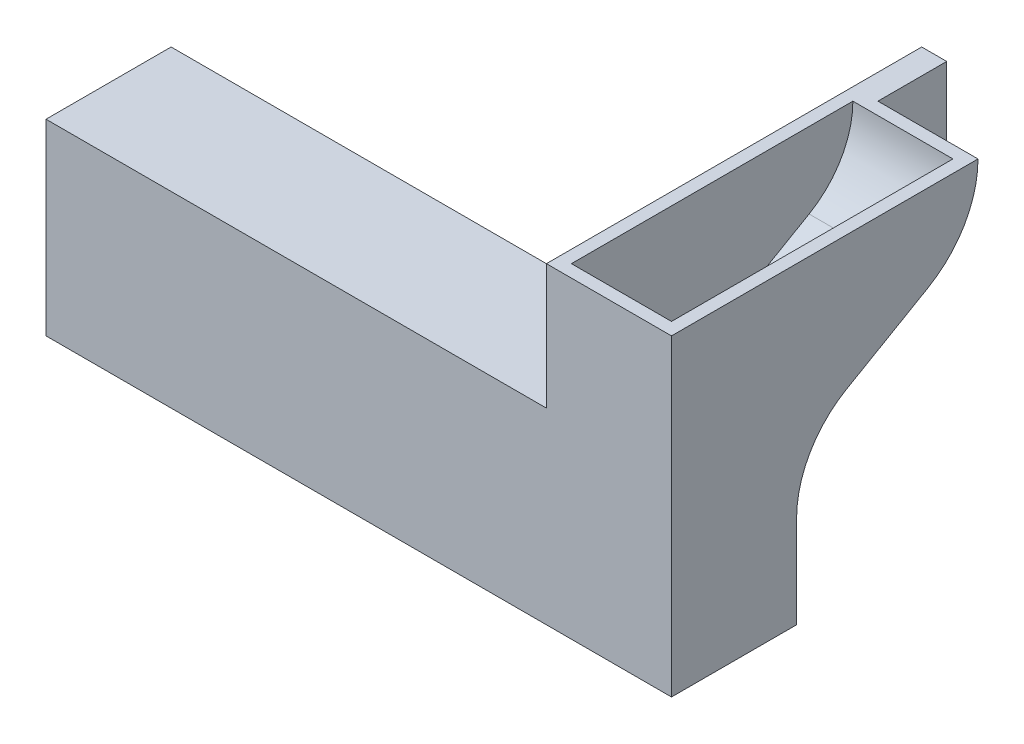
ISO-10303-21;
HEADER;
FILE_DESCRIPTION(('STEP AP214'),'2;1');
FILE_NAME('part.step','',(''),(''),'','','');
FILE_SCHEMA(('AUTOMOTIVE_DESIGN { 1 0 10303 214 1 1 1 1 }'));
ENDSEC;
DATA;
#1=APPLICATION_CONTEXT('core data for automotive mechanical design processes');
#2=APPLICATION_PROTOCOL_DEFINITION('international standard','automotive_design',2000,#1);
#3=PRODUCT_CONTEXT('',#1,'mechanical');
#4=PRODUCT('Part','Part','',(#3));
#5=PRODUCT_RELATED_PRODUCT_CATEGORY('part','',(#4));
#6=PRODUCT_DEFINITION_FORMATION('','',#4);
#7=PRODUCT_DEFINITION_CONTEXT('part definition',#1,'design');
#8=PRODUCT_DEFINITION('design','',#6,#7);
#9=PRODUCT_DEFINITION_SHAPE('','',#8);
#10=(LENGTH_UNIT() NAMED_UNIT(*) SI_UNIT(.MILLI.,.METRE.));
#11=(NAMED_UNIT(*) PLANE_ANGLE_UNIT() SI_UNIT($,.RADIAN.));
#12=(NAMED_UNIT(*) SI_UNIT($,.STERADIAN.) SOLID_ANGLE_UNIT());
#13=UNCERTAINTY_MEASURE_WITH_UNIT(LENGTH_MEASURE(1.E-05),#10,'distance_accuracy_value','');
#14=(GEOMETRIC_REPRESENTATION_CONTEXT(3) GLOBAL_UNCERTAINTY_ASSIGNED_CONTEXT((#13)) GLOBAL_UNIT_ASSIGNED_CONTEXT((#10,
#11,#12)) REPRESENTATION_CONTEXT('',''));
#15=CARTESIAN_POINT('',(0.,0.,0.));
#16=DIRECTION('',(0.,0.,1.));
#17=DIRECTION('',(1.,0.,0.));
#18=AXIS2_PLACEMENT_3D('',#15,#16,#17);
#19=CARTESIAN_POINT('',(-15.,1.,5.));
#20=DIRECTION('',(0.,-1.,0.));
#21=DIRECTION('',(0.,0.,-1.));
#22=AXIS2_PLACEMENT_3D('',#19,#20,#21);
#23=CYLINDRICAL_SURFACE('',#22,4.);
#24=DIRECTION('',(0.,1.,0.));
#25=VECTOR('',#24,1.);
#26=CARTESIAN_POINT('',(-15.,1.,9.));
#27=LINE('',#26,#25);
#28=CARTESIAN_POINT('',(-15.,1.,9.));
#29=VERTEX_POINT('',#28);
#30=CARTESIAN_POINT('',(-15.,14.,9.));
#31=VERTEX_POINT('',#30);
#32=EDGE_CURVE('E380',#29,#31,#27,.T.);
#33=ORIENTED_EDGE('',*,*,#32,.F.);
#34=CARTESIAN_POINT('',(-15.,1.,5.));
#35=DIRECTION('',(0.,-1.,0.));
#36=DIRECTION('',(0.,0.,-1.));
#37=AXIS2_PLACEMENT_3D('',#34,#35,#36);
#38=CIRCLE('',#37,4.);
#39=CARTESIAN_POINT('',(-15.,1.,1.));
#40=VERTEX_POINT('',#39);
#41=EDGE_CURVE('E48',#40,#29,#38,.F.);
#42=ORIENTED_EDGE('',*,*,#41,.F.);
#43=DIRECTION('',(0.,1.,0.));
#44=VECTOR('',#43,1.);
#45=CARTESIAN_POINT('',(-15.,1.,1.));
#46=LINE('',#45,#44);
#47=CARTESIAN_POINT('',(-15.,14.,1.));
#48=VERTEX_POINT('',#47);
#49=EDGE_CURVE('E383',#48,#40,#46,.F.);
#50=ORIENTED_EDGE('',*,*,#49,.F.);
#51=CARTESIAN_POINT('',(-15.,14.,5.));
#52=DIRECTION('',(0.,-1.,0.));
#53=DIRECTION('',(0.,0.,-1.));
#54=AXIS2_PLACEMENT_3D('',#51,#52,#53);
#55=CIRCLE('',#54,4.);
#56=EDGE_CURVE('E11',#31,#48,#55,.T.);
#57=ORIENTED_EDGE('',*,*,#56,.F.);
#58=EDGE_LOOP('',(#33,#42,#50,#57));
#59=FACE_BOUND('',#58,.T.);
#60=ADVANCED_FACE('F40',(#59),#23,.F.);
#61=CARTESIAN_POINT('',(30.,25.,10.));
#62=DIRECTION('',(0.,-1.,0.));
#63=DIRECTION('',(0.,0.,-1.));
#64=AXIS2_PLACEMENT_3D('',#61,#62,#63);
#65=PLANE('',#64);
#66=DIRECTION('',(0.,0.,1.));
#67=VECTOR('',#66,1.);
#68=CARTESIAN_POINT('',(20.,25.,10.));
#69=LINE('',#68,#67);
#70=CARTESIAN_POINT('',(20.,25.,-20.));
#71=VERTEX_POINT('',#70);
#72=CARTESIAN_POINT('',(20.,25.,10.));
#73=VERTEX_POINT('',#72);
#74=EDGE_CURVE('E330',#71,#73,#69,.T.);
#75=ORIENTED_EDGE('',*,*,#74,.T.);
#76=DIRECTION('',(-1.,0.,0.));
#77=VECTOR('',#76,1.);
#78=CARTESIAN_POINT('',(30.,25.,10.));
#79=LINE('',#78,#77);
#80=CARTESIAN_POINT('',(30.,25.,10.));
#81=VERTEX_POINT('',#80);
#82=EDGE_CURVE('E325',#81,#73,#79,.T.);
#83=ORIENTED_EDGE('',*,*,#82,.F.);
#84=DIRECTION('',(0.,0.,1.));
#85=VECTOR('',#84,1.);
#86=CARTESIAN_POINT('',(30.,25.,10.));
#87=LINE('',#86,#85);
#88=CARTESIAN_POINT('',(30.,25.,-14.5));
#89=VERTEX_POINT('',#88);
#90=EDGE_CURVE('E318',#89,#81,#87,.T.);
#91=ORIENTED_EDGE('',*,*,#90,.F.);
#92=DIRECTION('',(-1.,0.,0.));
#93=VECTOR('',#92,1.);
#94=CARTESIAN_POINT('',(30.,25.,-14.5));
#95=LINE('',#94,#93);
#96=CARTESIAN_POINT('',(22.,25.,-14.5));
#97=VERTEX_POINT('',#96);
#98=EDGE_CURVE('E337',#89,#97,#95,.T.);
#99=ORIENTED_EDGE('',*,*,#98,.T.);
#100=DIRECTION('',(0.,0.,-1.));
#101=VECTOR('',#100,1.);
#102=CARTESIAN_POINT('',(22.,25.,-20.));
#103=LINE('',#102,#101);
#104=CARTESIAN_POINT('',(22.,25.,-20.));
#105=VERTEX_POINT('',#104);
#106=EDGE_CURVE('E284',#97,#105,#103,.T.);
#107=ORIENTED_EDGE('',*,*,#106,.T.);
#108=DIRECTION('',(-1.,0.,0.));
#109=VECTOR('',#108,1.);
#110=CARTESIAN_POINT('',(22.,25.,-20.));
#111=LINE('',#110,#109);
#112=EDGE_CURVE('E294',#105,#71,#111,.T.);
#113=ORIENTED_EDGE('',*,*,#112,.T.);
#114=EDGE_LOOP('',(#75,#83,#91,#99,#107,#113));
#115=FACE_BOUND('',#114,.T.);
#116=DIRECTION('',(-1.,0.,0.));
#117=VECTOR('',#116,1.);
#118=CARTESIAN_POINT('',(29.,25.,-13.5));
#119=LINE('',#118,#117);
#120=CARTESIAN_POINT('',(29.,25.,-13.5));
#121=VERTEX_POINT('',#120);
#122=CARTESIAN_POINT('',(21.,25.,-13.5));
#123=VERTEX_POINT('',#122);
#124=EDGE_CURVE('E208',#121,#123,#119,.T.);
#125=ORIENTED_EDGE('',*,*,#124,.F.);
#126=DIRECTION('',(0.,0.,1.));
#127=VECTOR('',#126,1.);
#128=CARTESIAN_POINT('',(29.,25.,-6.5));
#129=LINE('',#128,#127);
#130=CARTESIAN_POINT('',(29.,25.,9.));
#131=VERTEX_POINT('',#130);
#132=EDGE_CURVE('E255',#121,#131,#129,.T.);
#133=ORIENTED_EDGE('',*,*,#132,.T.);
#134=DIRECTION('',(-1.,0.,0.));
#135=VECTOR('',#134,1.);
#136=CARTESIAN_POINT('',(20.,25.,9.));
#137=LINE('',#136,#135);
#138=CARTESIAN_POINT('',(21.,25.,9.));
#139=VERTEX_POINT('',#138);
#140=EDGE_CURVE('E220',#131,#139,#137,.T.);
#141=ORIENTED_EDGE('',*,*,#140,.T.);
#142=DIRECTION('',(0.,0.,1.));
#143=VECTOR('',#142,1.);
#144=CARTESIAN_POINT('',(21.,25.,-6.5));
#145=LINE('',#144,#143);
#146=EDGE_CURVE('E200',#123,#139,#145,.T.);
#147=ORIENTED_EDGE('',*,*,#146,.F.);
#148=EDGE_LOOP('',(#125,#133,#141,#147));
#149=FACE_BOUND('',#148,.T.);
#150=ADVANCED_FACE('F405',(#115,#149),#65,.F.);
#151=CARTESIAN_POINT('',(30.,25.,-6.5));
#152=DIRECTION('',(-1.,0.,0.));
#153=DIRECTION('',(0.,0.,1.));
#154=AXIS2_PLACEMENT_3D('',#151,#152,#153);
#155=CYLINDRICAL_SURFACE('',#154,8.);
#156=CARTESIAN_POINT('',(22.,25.,-6.5));
#157=DIRECTION('',(1.,0.,0.));
#158=DIRECTION('',(0.,0.,1.));
#159=AXIS2_PLACEMENT_3D('',#156,#157,#158);
#160=CIRCLE('',#159,8.);
#161=CARTESIAN_POINT('',(22.,18.0717967697245,-10.5));
#162=VERTEX_POINT('',#161);
#163=EDGE_CURVE('E281',#162,#97,#160,.T.);
#164=ORIENTED_EDGE('',*,*,#163,.T.);
#165=ORIENTED_EDGE('',*,*,#98,.F.);
#166=CARTESIAN_POINT('',(30.,25.,-6.5));
#167=DIRECTION('',(1.,0.,0.));
#168=DIRECTION('',(0.,0.,1.));
#169=AXIS2_PLACEMENT_3D('',#166,#167,#168);
#170=CIRCLE('',#169,8.);
#171=CARTESIAN_POINT('',(30.,18.0717967697245,-10.5));
#172=VERTEX_POINT('',#171);
#173=EDGE_CURVE('E315',#172,#89,#170,.T.);
#174=ORIENTED_EDGE('',*,*,#173,.F.);
#175=DIRECTION('',(-1.,0.,0.));
#176=VECTOR('',#175,1.);
#177=CARTESIAN_POINT('',(30.,18.0717967697245,-10.5));
#178=LINE('',#177,#176);
#179=EDGE_CURVE('E341',#172,#162,#178,.T.);
#180=ORIENTED_EDGE('',*,*,#179,.T.);
#181=EDGE_LOOP('',(#164,#165,#174,#180));
#182=FACE_BOUND('',#181,.T.);
#183=ADVANCED_FACE('F408',(#182),#155,.T.);
#184=CARTESIAN_POINT('',(-20.,15.,10.));
#185=DIRECTION('',(1.,0.,0.));
#186=DIRECTION('',(0.,0.,-1.));
#187=AXIS2_PLACEMENT_3D('',#184,#185,#186);
#188=PLANE('',#187);
#189=DIRECTION('',(0.,0.,1.));
#190=VECTOR('',#189,1.);
#191=CARTESIAN_POINT('',(-20.,0.,10.));
#192=LINE('',#191,#190);
#193=CARTESIAN_POINT('',(-20.,0.,0.));
#194=VERTEX_POINT('',#193);
#195=CARTESIAN_POINT('',(-20.,0.,10.));
#196=VERTEX_POINT('',#195);
#197=EDGE_CURVE('E350',#194,#196,#192,.T.);
#198=ORIENTED_EDGE('',*,*,#197,.T.);
#199=DIRECTION('',(0.,-1.,0.));
#200=VECTOR('',#199,1.);
#201=CARTESIAN_POINT('',(-20.,15.,10.));
#202=LINE('',#201,#200);
#203=CARTESIAN_POINT('',(-20.,15.,10.));
#204=VERTEX_POINT('',#203);
#205=EDGE_CURVE('E377',#204,#196,#202,.T.);
#206=ORIENTED_EDGE('',*,*,#205,.F.);
#207=DIRECTION('',(0.,0.,1.));
#208=VECTOR('',#207,1.);
#209=CARTESIAN_POINT('',(-20.,15.,10.));
#210=LINE('',#209,#208);
#211=CARTESIAN_POINT('',(-20.,15.,0.));
#212=VERTEX_POINT('',#211);
#213=EDGE_CURVE('E351',#212,#204,#210,.T.);
#214=ORIENTED_EDGE('',*,*,#213,.F.);
#215=DIRECTION('',(0.,-1.,0.));
#216=VECTOR('',#215,1.);
#217=CARTESIAN_POINT('',(-20.,15.,0.));
#218=LINE('',#217,#216);
#219=EDGE_CURVE('E364',#212,#194,#218,.T.);
#220=ORIENTED_EDGE('',*,*,#219,.T.);
#221=EDGE_LOOP('',(#198,#206,#214,#220));
#222=FACE_BOUND('',#221,.T.);
#223=ADVANCED_FACE('F415',(#222),#188,.F.);
#224=CARTESIAN_POINT('',(20.,15.,10.));
#225=DIRECTION('',(0.,0.,-1.));
#226=DIRECTION('',(-1.,0.,0.));
#227=AXIS2_PLACEMENT_3D('',#224,#225,#226);
#228=PLANE('',#227);
#229=DIRECTION('',(1.,0.,0.));
#230=VECTOR('',#229,1.);
#231=CARTESIAN_POINT('',(20.,0.,10.));
#232=LINE('',#231,#230);
#233=CARTESIAN_POINT('',(30.,0.,10.));
#234=VERTEX_POINT('',#233);
#235=EDGE_CURVE('E367',#196,#234,#232,.T.);
#236=ORIENTED_EDGE('',*,*,#235,.T.);
#237=DIRECTION('',(0.,-1.,0.));
#238=VECTOR('',#237,1.);
#239=CARTESIAN_POINT('',(30.,0.,10.));
#240=LINE('',#239,#238);
#241=EDGE_CURVE('E321',#81,#234,#240,.T.);
#242=ORIENTED_EDGE('',*,*,#241,.F.);
#243=ORIENTED_EDGE('',*,*,#82,.T.);
#244=DIRECTION('',(0.,-1.,0.));
#245=VECTOR('',#244,1.);
#246=CARTESIAN_POINT('',(20.,0.,10.));
#247=LINE('',#246,#245);
#248=CARTESIAN_POINT('',(20.,15.,10.));
#249=VERTEX_POINT('',#248);
#250=EDGE_CURVE('E307',#73,#249,#247,.T.);
#251=ORIENTED_EDGE('',*,*,#250,.T.);
#252=DIRECTION('',(1.,0.,0.));
#253=VECTOR('',#252,1.);
#254=CARTESIAN_POINT('',(20.,15.,10.));
#255=LINE('',#254,#253);
#256=EDGE_CURVE('E354',#204,#249,#255,.T.);
#257=ORIENTED_EDGE('',*,*,#256,.F.);
#258=ORIENTED_EDGE('',*,*,#205,.T.);
#259=EDGE_LOOP('',(#236,#242,#243,#251,#257,#258));
#260=FACE_BOUND('',#259,.T.);
#261=ADVANCED_FACE('F443',(#260),#228,.F.);
#262=CARTESIAN_POINT('',(-20.,15.,0.));
#263=DIRECTION('',(0.,0.,1.));
#264=DIRECTION('',(1.,0.,0.));
#265=AXIS2_PLACEMENT_3D('',#262,#263,#264);
#266=PLANE('',#265);
#267=DIRECTION('',(-1.,0.,0.));
#268=VECTOR('',#267,1.);
#269=CARTESIAN_POINT('',(-20.,0.,0.));
#270=LINE('',#269,#268);
#271=CARTESIAN_POINT('',(30.,0.,0.));
#272=VERTEX_POINT('',#271);
#273=EDGE_CURVE('E355',#272,#194,#270,.T.);
#274=ORIENTED_EDGE('',*,*,#273,.T.);
#275=ORIENTED_EDGE('',*,*,#219,.F.);
#276=DIRECTION('',(-1.,0.,0.));
#277=VECTOR('',#276,1.);
#278=CARTESIAN_POINT('',(-20.,15.,0.));
#279=LINE('',#278,#277);
#280=CARTESIAN_POINT('',(20.,15.,0.));
#281=VERTEX_POINT('',#280);
#282=EDGE_CURVE('E362',#281,#212,#279,.T.);
#283=ORIENTED_EDGE('',*,*,#282,.F.);
#284=DIRECTION('',(0.,-1.,0.));
#285=VECTOR('',#284,1.);
#286=CARTESIAN_POINT('',(20.,15.,0.));
#287=LINE('',#286,#285);
#288=CARTESIAN_POINT('',(20.,7.39081678971644,0.));
#289=VERTEX_POINT('',#288);
#290=EDGE_CURVE('E373',#281,#289,#287,.T.);
#291=ORIENTED_EDGE('',*,*,#290,.T.);
#292=DIRECTION('',(-1.,0.,0.));
#293=VECTOR('',#292,1.);
#294=CARTESIAN_POINT('',(30.,7.39081678971644,0.));
#295=LINE('',#294,#293);
#296=CARTESIAN_POINT('',(30.,7.39081678971644,0.));
#297=VERTEX_POINT('',#296);
#298=EDGE_CURVE('E347',#297,#289,#295,.T.);
#299=ORIENTED_EDGE('',*,*,#298,.F.);
#300=DIRECTION('',(0.,1.,0.));
#301=VECTOR('',#300,1.);
#302=CARTESIAN_POINT('',(30.,7.39081678971644,0.));
#303=LINE('',#302,#301);
#304=EDGE_CURVE('E306',#272,#297,#303,.T.);
#305=ORIENTED_EDGE('',*,*,#304,.F.);
#306=EDGE_LOOP('',(#274,#275,#283,#291,#299,#305));
#307=FACE_BOUND('',#306,.T.);
#308=ADVANCED_FACE('F436',(#307),#266,.F.);
#309=CARTESIAN_POINT('',(0.,15.,0.));
#310=DIRECTION('',(0.,-1.,0.));
#311=DIRECTION('',(0.,0.,-1.));
#312=AXIS2_PLACEMENT_3D('',#309,#310,#311);
#313=PLANE('',#312);
#314=ORIENTED_EDGE('',*,*,#213,.T.);
#315=ORIENTED_EDGE('',*,*,#256,.T.);
#316=DIRECTION('',(0.,0.,-1.));
#317=VECTOR('',#316,1.);
#318=CARTESIAN_POINT('',(20.,15.,0.));
#319=LINE('',#318,#317);
#320=EDGE_CURVE('E359',#249,#281,#319,.T.);
#321=ORIENTED_EDGE('',*,*,#320,.T.);
#322=ORIENTED_EDGE('',*,*,#282,.T.);
#323=EDGE_LOOP('',(#314,#315,#321,#322));
#324=FACE_BOUND('',#323,.T.);
#325=ADVANCED_FACE('F433',(#324),#313,.F.);
#326=CARTESIAN_POINT('',(0.,0.,0.));
#327=DIRECTION('',(0.,-1.,0.));
#328=DIRECTION('',(0.,0.,-1.));
#329=AXIS2_PLACEMENT_3D('',#326,#327,#328);
#330=PLANE('',#329);
#331=ORIENTED_EDGE('',*,*,#197,.F.);
#332=ORIENTED_EDGE('',*,*,#273,.F.);
#333=DIRECTION('',(0.,0.,-1.));
#334=VECTOR('',#333,1.);
#335=CARTESIAN_POINT('',(30.,0.,0.));
#336=LINE('',#335,#334);
#337=EDGE_CURVE('E303',#234,#272,#336,.T.);
#338=ORIENTED_EDGE('',*,*,#337,.F.);
#339=ORIENTED_EDGE('',*,*,#235,.F.);
#340=EDGE_LOOP('',(#331,#332,#338,#339));
#341=FACE_BOUND('',#340,.T.);
#342=ADVANCED_FACE('F431',(#341),#330,.T.);
#343=CARTESIAN_POINT('',(30.,7.39081678971644,-8.));
#344=DIRECTION('',(-1.,0.,0.));
#345=DIRECTION('',(0.,0.,1.));
#346=AXIS2_PLACEMENT_3D('',#343,#344,#345);
#347=CYLINDRICAL_SURFACE('',#346,8.);
#348=CARTESIAN_POINT('',(20.,7.39081678971644,-8.));
#349=DIRECTION('',(-1.,0.,0.));
#350=DIRECTION('',(0.,0.,-1.));
#351=AXIS2_PLACEMENT_3D('',#348,#349,#350);
#352=CIRCLE('',#351,8.);
#353=CARTESIAN_POINT('',(20.,14.319020019992,-4.00000000000002));
#354=VERTEX_POINT('',#353);
#355=EDGE_CURVE('E298',#289,#354,#352,.T.);
#356=ORIENTED_EDGE('',*,*,#355,.T.);
#357=DIRECTION('',(-1.,0.,0.));
#358=VECTOR('',#357,1.);
#359=CARTESIAN_POINT('',(30.,14.319020019992,-4.00000000000002));
#360=LINE('',#359,#358);
#361=CARTESIAN_POINT('',(30.,14.319020019992,-4.00000000000002));
#362=VERTEX_POINT('',#361);
#363=EDGE_CURVE('E344',#362,#354,#360,.T.);
#364=ORIENTED_EDGE('',*,*,#363,.F.);
#365=CARTESIAN_POINT('',(30.,7.39081678971644,-8.));
#366=DIRECTION('',(-1.,0.,0.));
#367=DIRECTION('',(0.,0.,-1.));
#368=AXIS2_PLACEMENT_3D('',#365,#366,#367);
#369=CIRCLE('',#368,8.);
#370=EDGE_CURVE('E310',#297,#362,#369,.T.);
#371=ORIENTED_EDGE('',*,*,#370,.F.);
#372=ORIENTED_EDGE('',*,*,#298,.T.);
#373=EDGE_LOOP('',(#356,#364,#371,#372));
#374=FACE_BOUND('',#373,.T.);
#375=ADVANCED_FACE('F427',(#374),#347,.F.);
#376=CARTESIAN_POINT('',(30.,18.0717967697245,-10.5));
#377=DIRECTION('',(0.,0.86602540378444,0.499999999999998));
#378=DIRECTION('',(0.,-0.499999999999998,0.86602540378444));
#379=AXIS2_PLACEMENT_3D('',#376,#377,#378);
#380=PLANE('',#379);
#381=DIRECTION('',(0.,0.499999999999998,-0.86602540378444));
#382=VECTOR('',#381,1.);
#383=CARTESIAN_POINT('',(20.,18.0717967697245,-10.5));
#384=LINE('',#383,#382);
#385=CARTESIAN_POINT('',(20.,15.,-5.17949192431119));
#386=VERTEX_POINT('',#385);
#387=EDGE_CURVE('E328',#354,#386,#384,.T.);
#388=ORIENTED_EDGE('',*,*,#387,.T.);
#389=DIRECTION('',(-1.,0.,0.));
#390=VECTOR('',#389,1.);
#391=CARTESIAN_POINT('',(22.,15.,-5.17949192431118));
#392=LINE('',#391,#390);
#393=CARTESIAN_POINT('',(22.,15.,-5.17949192431118));
#394=VERTEX_POINT('',#393);
#395=EDGE_CURVE('E299',#394,#386,#392,.T.);
#396=ORIENTED_EDGE('',*,*,#395,.F.);
#397=DIRECTION('',(0.,0.499999999999998,-0.86602540378444));
#398=VECTOR('',#397,1.);
#399=CARTESIAN_POINT('',(22.,15.,-5.17949192431118));
#400=LINE('',#399,#398);
#401=EDGE_CURVE('E279',#394,#162,#400,.T.);
#402=ORIENTED_EDGE('',*,*,#401,.T.);
#403=ORIENTED_EDGE('',*,*,#179,.F.);
#404=DIRECTION('',(0.,0.499999999999998,-0.86602540378444));
#405=VECTOR('',#404,1.);
#406=CARTESIAN_POINT('',(30.,18.0717967697245,-10.5));
#407=LINE('',#406,#405);
#408=EDGE_CURVE('E313',#362,#172,#407,.T.);
#409=ORIENTED_EDGE('',*,*,#408,.F.);
#410=ORIENTED_EDGE('',*,*,#363,.T.);
#411=EDGE_LOOP('',(#388,#396,#402,#403,#409,#410));
#412=FACE_BOUND('',#411,.T.);
#413=ADVANCED_FACE('F423',(#412),#380,.F.);
#414=CARTESIAN_POINT('',(30.,25.,-6.5));
#415=DIRECTION('',(-1.,0.,0.));
#416=DIRECTION('',(0.,0.,1.));
#417=AXIS2_PLACEMENT_3D('',#414,#415,#416);
#418=PLANE('',#417);
#419=ORIENTED_EDGE('',*,*,#337,.T.);
#420=ORIENTED_EDGE('',*,*,#304,.T.);
#421=ORIENTED_EDGE('',*,*,#370,.T.);
#422=ORIENTED_EDGE('',*,*,#408,.T.);
#423=ORIENTED_EDGE('',*,*,#173,.T.);
#424=ORIENTED_EDGE('',*,*,#90,.T.);
#425=ORIENTED_EDGE('',*,*,#241,.T.);
#426=EDGE_LOOP('',(#419,#420,#421,#422,#423,#424,#425));
#427=FACE_BOUND('',#426,.T.);
#428=ADVANCED_FACE('F426',(#427),#418,.F.);
#429=CARTESIAN_POINT('',(20.,25.,-6.5));
#430=DIRECTION('',(-1.,0.,0.));
#431=DIRECTION('',(0.,0.,1.));
#432=AXIS2_PLACEMENT_3D('',#429,#430,#431);
#433=PLANE('',#432);
#434=ORIENTED_EDGE('',*,*,#74,.F.);
#435=DIRECTION('',(0.,-1.,0.));
#436=VECTOR('',#435,1.);
#437=CARTESIAN_POINT('',(20.,15.,-20.));
#438=LINE('',#437,#436);
#439=CARTESIAN_POINT('',(20.,15.,-20.));
#440=VERTEX_POINT('',#439);
#441=EDGE_CURVE('E246',#71,#440,#438,.T.);
#442=ORIENTED_EDGE('',*,*,#441,.T.);
#443=DIRECTION('',(0.,0.,1.));
#444=VECTOR('',#443,1.);
#445=CARTESIAN_POINT('',(20.,15.,-5.17949192431118));
#446=LINE('',#445,#444);
#447=EDGE_CURVE('E276',#440,#386,#446,.T.);
#448=ORIENTED_EDGE('',*,*,#447,.T.);
#449=ORIENTED_EDGE('',*,*,#387,.F.);
#450=ORIENTED_EDGE('',*,*,#355,.F.);
#451=ORIENTED_EDGE('',*,*,#290,.F.);
#452=ORIENTED_EDGE('',*,*,#320,.F.);
#453=ORIENTED_EDGE('',*,*,#250,.F.);
#454=EDGE_LOOP('',(#434,#442,#448,#449,#450,#451,#452,#453));
#455=FACE_BOUND('',#454,.T.);
#456=ADVANCED_FACE('F420',(#455),#433,.T.);
#457=CARTESIAN_POINT('',(22.,15.,-20.));
#458=DIRECTION('',(0.,0.,-1.));
#459=DIRECTION('',(-1.,0.,0.));
#460=AXIS2_PLACEMENT_3D('',#457,#458,#459);
#461=PLANE('',#460);
#462=ORIENTED_EDGE('',*,*,#441,.F.);
#463=ORIENTED_EDGE('',*,*,#112,.F.);
#464=DIRECTION('',(0.,-1.,0.));
#465=VECTOR('',#464,1.);
#466=CARTESIAN_POINT('',(22.,15.,-20.));
#467=LINE('',#466,#465);
#468=CARTESIAN_POINT('',(22.,15.,-20.));
#469=VERTEX_POINT('',#468);
#470=EDGE_CURVE('E271',#105,#469,#467,.T.);
#471=ORIENTED_EDGE('',*,*,#470,.T.);
#472=DIRECTION('',(-1.,0.,0.));
#473=VECTOR('',#472,1.);
#474=CARTESIAN_POINT('',(22.,15.,-20.));
#475=LINE('',#474,#473);
#476=EDGE_CURVE('E288',#469,#440,#475,.T.);
#477=ORIENTED_EDGE('',*,*,#476,.T.);
#478=EDGE_LOOP('',(#462,#463,#471,#477));
#479=FACE_BOUND('',#478,.T.);
#480=ADVANCED_FACE('F483',(#479),#461,.T.);
#481=CARTESIAN_POINT('',(22.,15.,-5.17949192431118));
#482=DIRECTION('',(0.,-1.,0.));
#483=DIRECTION('',(0.,0.,-1.));
#484=AXIS2_PLACEMENT_3D('',#481,#482,#483);
#485=PLANE('',#484);
#486=ORIENTED_EDGE('',*,*,#447,.F.);
#487=ORIENTED_EDGE('',*,*,#476,.F.);
#488=DIRECTION('',(0.,0.,1.));
#489=VECTOR('',#488,1.);
#490=CARTESIAN_POINT('',(22.,15.,-5.17949192431118));
#491=LINE('',#490,#489);
#492=EDGE_CURVE('E275',#469,#394,#491,.T.);
#493=ORIENTED_EDGE('',*,*,#492,.T.);
#494=ORIENTED_EDGE('',*,*,#395,.T.);
#495=EDGE_LOOP('',(#486,#487,#493,#494));
#496=FACE_BOUND('',#495,.T.);
#497=ADVANCED_FACE('F486',(#496),#485,.T.);
#498=CARTESIAN_POINT('',(22.,25.,-6.5));
#499=DIRECTION('',(-1.,0.,0.));
#500=DIRECTION('',(0.,0.,1.));
#501=AXIS2_PLACEMENT_3D('',#498,#499,#500);
#502=PLANE('',#501);
#503=ORIENTED_EDGE('',*,*,#470,.F.);
#504=ORIENTED_EDGE('',*,*,#106,.F.);
#505=ORIENTED_EDGE('',*,*,#163,.F.);
#506=ORIENTED_EDGE('',*,*,#401,.F.);
#507=ORIENTED_EDGE('',*,*,#492,.F.);
#508=EDGE_LOOP('',(#503,#504,#505,#506,#507));
#509=FACE_BOUND('',#508,.T.);
#510=ADVANCED_FACE('F478',(#509),#502,.F.);
#511=CARTESIAN_POINT('',(30.,25.,-6.5));
#512=DIRECTION('',(-1.,0.,0.));
#513=DIRECTION('',(0.,0.,1.));
#514=AXIS2_PLACEMENT_3D('',#511,#512,#513);
#515=CYLINDRICAL_SURFACE('',#514,7.);
#516=CARTESIAN_POINT('',(21.,25.,-6.5));
#517=DIRECTION('',(-1.,0.,0.));
#518=DIRECTION('',(0.,0.,1.));
#519=AXIS2_PLACEMENT_3D('',#516,#517,#518);
#520=CIRCLE('',#519,7.);
#521=CARTESIAN_POINT('',(21.,18.9378221735089,-9.99999999999999));
#522=VERTEX_POINT('',#521);
#523=EDGE_CURVE('E191',#522,#123,#520,.F.);
#524=ORIENTED_EDGE('',*,*,#523,.F.);
#525=DIRECTION('',(-1.,0.,0.));
#526=VECTOR('',#525,1.);
#527=CARTESIAN_POINT('',(30.,18.9378221735089,-9.99999999999999));
#528=LINE('',#527,#526);
#529=CARTESIAN_POINT('',(29.,18.9378221735089,-9.99999999999999));
#530=VERTEX_POINT('',#529);
#531=EDGE_CURVE('E205',#530,#522,#528,.T.);
#532=ORIENTED_EDGE('',*,*,#531,.F.);
#533=CARTESIAN_POINT('',(29.,25.,-6.5));
#534=DIRECTION('',(-1.,0.,0.));
#535=DIRECTION('',(0.,0.,1.));
#536=AXIS2_PLACEMENT_3D('',#533,#534,#535);
#537=CIRCLE('',#536,7.);
#538=EDGE_CURVE('E223',#530,#121,#537,.F.);
#539=ORIENTED_EDGE('',*,*,#538,.T.);
#540=ORIENTED_EDGE('',*,*,#124,.T.);
#541=EDGE_LOOP('',(#524,#532,#539,#540));
#542=FACE_BOUND('',#541,.T.);
#543=ADVANCED_FACE('F204',(#542),#515,.F.);
#544=CARTESIAN_POINT('',(20.,15.,9.));
#545=DIRECTION('',(0.,0.,-1.));
#546=DIRECTION('',(-1.,0.,0.));
#547=AXIS2_PLACEMENT_3D('',#544,#545,#546);
#548=PLANE('',#547);
#549=DIRECTION('',(1.,0.,0.));
#550=VECTOR('',#549,1.);
#551=CARTESIAN_POINT('',(0.,1.,9.));
#552=LINE('',#551,#550);
#553=CARTESIAN_POINT('',(29.,1.,9.));
#554=VERTEX_POINT('',#553);
#555=EDGE_CURVE('E233',#29,#554,#552,.T.);
#556=ORIENTED_EDGE('',*,*,#555,.F.);
#557=ORIENTED_EDGE('',*,*,#32,.T.);
#558=DIRECTION('',(1.,0.,0.));
#559=VECTOR('',#558,1.);
#560=CARTESIAN_POINT('',(0.,14.,9.));
#561=LINE('',#560,#559);
#562=CARTESIAN_POINT('',(21.,14.,9.));
#563=VERTEX_POINT('',#562);
#564=EDGE_CURVE('E238',#31,#563,#561,.T.);
#565=ORIENTED_EDGE('',*,*,#564,.T.);
#566=DIRECTION('',(0.,-1.,0.));
#567=VECTOR('',#566,1.);
#568=CARTESIAN_POINT('',(21.,25.,9.));
#569=LINE('',#568,#567);
#570=EDGE_CURVE('E256',#139,#563,#569,.T.);
#571=ORIENTED_EDGE('',*,*,#570,.F.);
#572=ORIENTED_EDGE('',*,*,#140,.F.);
#573=DIRECTION('',(0.,-1.,0.));
#574=VECTOR('',#573,1.);
#575=CARTESIAN_POINT('',(29.,25.,9.));
#576=LINE('',#575,#574);
#577=EDGE_CURVE('E251',#131,#554,#576,.T.);
#578=ORIENTED_EDGE('',*,*,#577,.T.);
#579=EDGE_LOOP('',(#556,#557,#565,#571,#572,#578));
#580=FACE_BOUND('',#579,.T.);
#581=ADVANCED_FACE('F388',(#580),#548,.T.);
#582=CARTESIAN_POINT('',(-20.,15.,1.));
#583=DIRECTION('',(0.,0.,1.));
#584=DIRECTION('',(1.,0.,0.));
#585=AXIS2_PLACEMENT_3D('',#582,#583,#584);
#586=PLANE('',#585);
#587=DIRECTION('',(-1.,0.,0.));
#588=VECTOR('',#587,1.);
#589=CARTESIAN_POINT('',(0.,14.,1.));
#590=LINE('',#589,#588);
#591=CARTESIAN_POINT('',(21.,14.,1.));
#592=VERTEX_POINT('',#591);
#593=EDGE_CURVE('E239',#592,#48,#590,.T.);
#594=ORIENTED_EDGE('',*,*,#593,.T.);
#595=ORIENTED_EDGE('',*,*,#49,.T.);
#596=DIRECTION('',(-1.,0.,0.));
#597=VECTOR('',#596,1.);
#598=CARTESIAN_POINT('',(0.,1.,1.));
#599=LINE('',#598,#597);
#600=CARTESIAN_POINT('',(29.,1.,1.));
#601=VERTEX_POINT('',#600);
#602=EDGE_CURVE('E234',#601,#40,#599,.T.);
#603=ORIENTED_EDGE('',*,*,#602,.F.);
#604=DIRECTION('',(0.,1.,0.));
#605=VECTOR('',#604,1.);
#606=CARTESIAN_POINT('',(29.,25.,1.));
#607=LINE('',#606,#605);
#608=CARTESIAN_POINT('',(29.,7.39081678971644,1.));
#609=VERTEX_POINT('',#608);
#610=EDGE_CURVE('E230',#601,#609,#607,.T.);
#611=ORIENTED_EDGE('',*,*,#610,.T.);
#612=DIRECTION('',(-1.,0.,0.));
#613=VECTOR('',#612,1.);
#614=CARTESIAN_POINT('',(30.,7.39081678971644,1.));
#615=LINE('',#614,#613);
#616=CARTESIAN_POINT('',(21.,7.39081678971644,1.));
#617=VERTEX_POINT('',#616);
#618=EDGE_CURVE('E217',#609,#617,#615,.T.);
#619=ORIENTED_EDGE('',*,*,#618,.T.);
#620=DIRECTION('',(0.,-1.,0.));
#621=VECTOR('',#620,1.);
#622=CARTESIAN_POINT('',(21.,15.,1.));
#623=LINE('',#622,#621);
#624=EDGE_CURVE('E242',#592,#617,#623,.T.);
#625=ORIENTED_EDGE('',*,*,#624,.F.);
#626=EDGE_LOOP('',(#594,#595,#603,#611,#619,#625));
#627=FACE_BOUND('',#626,.T.);
#628=ADVANCED_FACE('F399',(#627),#586,.T.);
#629=CARTESIAN_POINT('',(0.,14.,0.));
#630=DIRECTION('',(0.,-1.,0.));
#631=DIRECTION('',(0.,0.,-1.));
#632=AXIS2_PLACEMENT_3D('',#629,#630,#631);
#633=PLANE('',#632);
#634=ORIENTED_EDGE('',*,*,#564,.F.);
#635=ORIENTED_EDGE('',*,*,#56,.T.);
#636=ORIENTED_EDGE('',*,*,#593,.F.);
#637=DIRECTION('',(0.,0.,-1.));
#638=VECTOR('',#637,1.);
#639=CARTESIAN_POINT('',(21.,14.,0.));
#640=LINE('',#639,#638);
#641=EDGE_CURVE('E243',#563,#592,#640,.T.);
#642=ORIENTED_EDGE('',*,*,#641,.F.);
#643=EDGE_LOOP('',(#634,#635,#636,#642));
#644=FACE_BOUND('',#643,.T.);
#645=ADVANCED_FACE('F403',(#644),#633,.T.);
#646=CARTESIAN_POINT('',(0.,1.,0.));
#647=DIRECTION('',(0.,-1.,0.));
#648=DIRECTION('',(0.,0.,-1.));
#649=AXIS2_PLACEMENT_3D('',#646,#647,#648);
#650=PLANE('',#649);
#651=ORIENTED_EDGE('',*,*,#602,.T.);
#652=ORIENTED_EDGE('',*,*,#41,.T.);
#653=ORIENTED_EDGE('',*,*,#555,.T.);
#654=DIRECTION('',(0.,0.,-1.));
#655=VECTOR('',#654,1.);
#656=CARTESIAN_POINT('',(29.,1.,0.));
#657=LINE('',#656,#655);
#658=EDGE_CURVE('E249',#554,#601,#657,.T.);
#659=ORIENTED_EDGE('',*,*,#658,.T.);
#660=EDGE_LOOP('',(#651,#652,#653,#659));
#661=FACE_BOUND('',#660,.T.);
#662=ADVANCED_FACE('F385',(#661),#650,.F.);
#663=CARTESIAN_POINT('',(30.,7.39081678971644,-8.));
#664=DIRECTION('',(-1.,0.,0.));
#665=DIRECTION('',(0.,0.,1.));
#666=AXIS2_PLACEMENT_3D('',#663,#664,#665);
#667=CYLINDRICAL_SURFACE('',#666,9.);
#668=CARTESIAN_POINT('',(21.,7.39081678971644,-8.));
#669=DIRECTION('',(-1.,0.,0.));
#670=DIRECTION('',(0.,0.,1.));
#671=AXIS2_PLACEMENT_3D('',#668,#669,#670);
#672=CIRCLE('',#671,9.);
#673=CARTESIAN_POINT('',(21.,15.1850454237764,-3.50000000000002));
#674=VERTEX_POINT('',#673);
#675=EDGE_CURVE('E195',#617,#674,#672,.T.);
#676=ORIENTED_EDGE('',*,*,#675,.F.);
#677=ORIENTED_EDGE('',*,*,#618,.F.);
#678=CARTESIAN_POINT('',(29.,7.39081678971644,-8.));
#679=DIRECTION('',(-1.,0.,0.));
#680=DIRECTION('',(0.,0.,1.));
#681=AXIS2_PLACEMENT_3D('',#678,#679,#680);
#682=CIRCLE('',#681,9.);
#683=CARTESIAN_POINT('',(29.,15.1850454237764,-3.50000000000002));
#684=VERTEX_POINT('',#683);
#685=EDGE_CURVE('E225',#609,#684,#682,.T.);
#686=ORIENTED_EDGE('',*,*,#685,.T.);
#687=DIRECTION('',(1.,0.,0.));
#688=VECTOR('',#687,1.);
#689=CARTESIAN_POINT('',(30.,15.1850454237764,-3.50000000000002));
#690=LINE('',#689,#688);
#691=EDGE_CURVE('E215',#684,#674,#690,.F.);
#692=ORIENTED_EDGE('',*,*,#691,.T.);
#693=EDGE_LOOP('',(#676,#677,#686,#692));
#694=FACE_BOUND('',#693,.T.);
#695=ADVANCED_FACE('F401',(#694),#667,.T.);
#696=CARTESIAN_POINT('',(30.,18.9378221735089,-9.99999999999998));
#697=DIRECTION('',(0.,0.86602540378444,0.499999999999998));
#698=DIRECTION('',(0.,-0.499999999999998,0.86602540378444));
#699=AXIS2_PLACEMENT_3D('',#696,#697,#698);
#700=PLANE('',#699);
#701=DIRECTION('',(0.,0.499999999999998,-0.86602540378444));
#702=VECTOR('',#701,1.);
#703=CARTESIAN_POINT('',(21.,18.9378221735089,-9.99999999999998));
#704=LINE('',#703,#702);
#705=EDGE_CURVE('E188',#674,#522,#704,.T.);
#706=ORIENTED_EDGE('',*,*,#705,.F.);
#707=ORIENTED_EDGE('',*,*,#691,.F.);
#708=DIRECTION('',(0.,0.499999999999998,-0.86602540378444));
#709=VECTOR('',#708,1.);
#710=CARTESIAN_POINT('',(29.,18.9378221735089,-9.99999999999998));
#711=LINE('',#710,#709);
#712=EDGE_CURVE('E214',#684,#530,#711,.T.);
#713=ORIENTED_EDGE('',*,*,#712,.T.);
#714=ORIENTED_EDGE('',*,*,#531,.T.);
#715=EDGE_LOOP('',(#706,#707,#713,#714));
#716=FACE_BOUND('',#715,.T.);
#717=ADVANCED_FACE('F212',(#716),#700,.T.);
#718=CARTESIAN_POINT('',(29.,25.,-6.5));
#719=DIRECTION('',(-1.,0.,0.));
#720=DIRECTION('',(0.,0.,1.));
#721=AXIS2_PLACEMENT_3D('',#718,#719,#720);
#722=PLANE('',#721);
#723=ORIENTED_EDGE('',*,*,#658,.F.);
#724=ORIENTED_EDGE('',*,*,#577,.F.);
#725=ORIENTED_EDGE('',*,*,#132,.F.);
#726=ORIENTED_EDGE('',*,*,#538,.F.);
#727=ORIENTED_EDGE('',*,*,#712,.F.);
#728=ORIENTED_EDGE('',*,*,#685,.F.);
#729=ORIENTED_EDGE('',*,*,#610,.F.);
#730=EDGE_LOOP('',(#723,#724,#725,#726,#727,#728,#729));
#731=FACE_BOUND('',#730,.T.);
#732=ADVANCED_FACE('F395',(#731),#722,.T.);
#733=CARTESIAN_POINT('',(21.,25.,-6.5));
#734=DIRECTION('',(-1.,0.,0.));
#735=DIRECTION('',(0.,0.,1.));
#736=AXIS2_PLACEMENT_3D('',#733,#734,#735);
#737=PLANE('',#736);
#738=ORIENTED_EDGE('',*,*,#523,.T.);
#739=ORIENTED_EDGE('',*,*,#146,.T.);
#740=ORIENTED_EDGE('',*,*,#570,.T.);
#741=ORIENTED_EDGE('',*,*,#641,.T.);
#742=ORIENTED_EDGE('',*,*,#624,.T.);
#743=ORIENTED_EDGE('',*,*,#675,.T.);
#744=ORIENTED_EDGE('',*,*,#705,.T.);
#745=EDGE_LOOP('',(#738,#739,#740,#741,#742,#743,#744));
#746=FACE_BOUND('',#745,.T.);
#747=ADVANCED_FACE('F190',(#746),#737,.F.);
#748=CLOSED_SHELL('',(#60,#150,#183,#223,#261,#308,#325,#342,#375,#413,#428,#456,#480,#497,#510,
#543,#581,#628,#645,#662,#695,#717,#732,#747));
#749=MANIFOLD_SOLID_BREP('B2',#748);
#750=ADVANCED_BREP_SHAPE_REPRESENTATION('',(#18,#749),#14);
#751=SHAPE_DEFINITION_REPRESENTATION(#9,#750);
ENDSEC;
END-ISO-10303-21;
